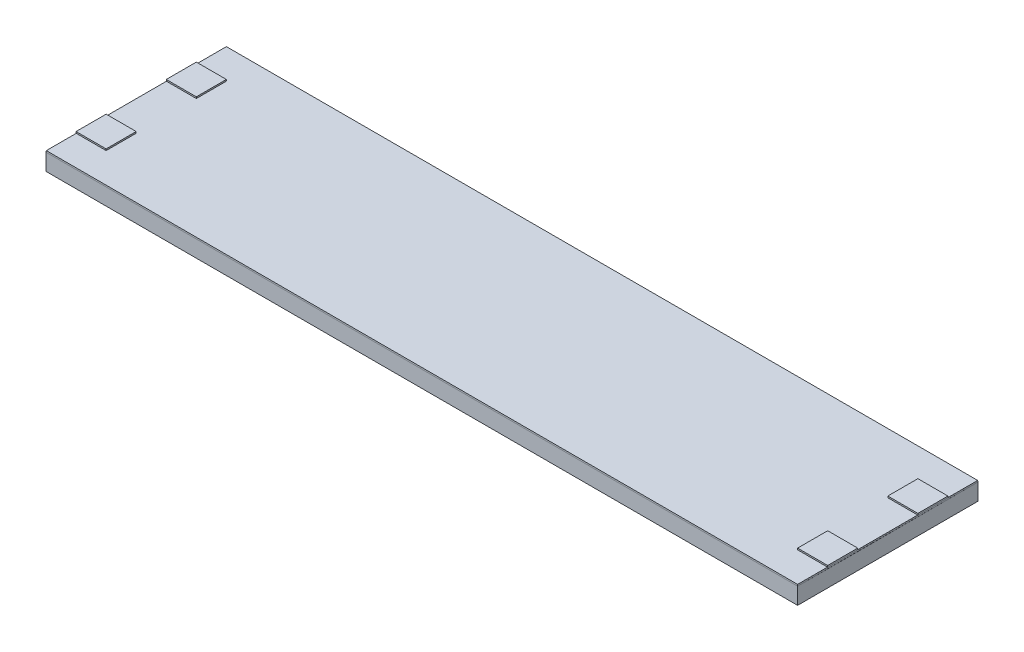
ISO-10303-21;
HEADER;
FILE_DESCRIPTION(('STEP AP214'),'2;1');
FILE_NAME('part.step','',(''),(''),'','','');
FILE_SCHEMA(('AUTOMOTIVE_DESIGN { 1 0 10303 214 1 1 1 1 }'));
ENDSEC;
DATA;
#1=APPLICATION_CONTEXT('core data for automotive mechanical design processes');
#2=APPLICATION_PROTOCOL_DEFINITION('international standard','automotive_design',2000,#1);
#3=PRODUCT_CONTEXT('',#1,'mechanical');
#4=PRODUCT('Part','Part','',(#3));
#5=PRODUCT_RELATED_PRODUCT_CATEGORY('part','',(#4));
#6=PRODUCT_DEFINITION_FORMATION('','',#4);
#7=PRODUCT_DEFINITION_CONTEXT('part definition',#1,'design');
#8=PRODUCT_DEFINITION('design','',#6,#7);
#9=PRODUCT_DEFINITION_SHAPE('','',#8);
#10=(LENGTH_UNIT() NAMED_UNIT(*) SI_UNIT(.MILLI.,.METRE.));
#11=(NAMED_UNIT(*) PLANE_ANGLE_UNIT() SI_UNIT($,.RADIAN.));
#12=(NAMED_UNIT(*) SI_UNIT($,.STERADIAN.) SOLID_ANGLE_UNIT());
#13=UNCERTAINTY_MEASURE_WITH_UNIT(LENGTH_MEASURE(1.E-05),#10,'distance_accuracy_value','');
#14=(GEOMETRIC_REPRESENTATION_CONTEXT(3) GLOBAL_UNCERTAINTY_ASSIGNED_CONTEXT((#13)) GLOBAL_UNIT_ASSIGNED_CONTEXT((#10,
#11,#12)) REPRESENTATION_CONTEXT('',''));
#15=CARTESIAN_POINT('',(0.,0.,0.));
#16=DIRECTION('',(0.,0.,1.));
#17=DIRECTION('',(1.,0.,0.));
#18=AXIS2_PLACEMENT_3D('',#15,#16,#17);
#19=CARTESIAN_POINT('',(0.,1.3,0.));
#20=DIRECTION('',(0.,-1.,0.));
#21=DIRECTION('',(0.,0.,-1.));
#22=AXIS2_PLACEMENT_3D('',#19,#20,#21);
#23=PLANE('',#22);
#24=DIRECTION('',(-1.,0.,0.));
#25=VECTOR('',#24,1.);
#26=CARTESIAN_POINT('',(48.,1.3,-10.));
#27=LINE('',#26,#25);
#28=CARTESIAN_POINT('',(50.,1.3,-10.));
#29=VERTEX_POINT('',#28);
#30=CARTESIAN_POINT('',(48.,1.3,-10.));
#31=VERTEX_POINT('',#30);
#32=EDGE_CURVE('E1162',#29,#31,#27,.T.);
#33=ORIENTED_EDGE('',*,*,#32,.T.);
#34=DIRECTION('',(0.,0.,1.));
#35=VECTOR('',#34,1.);
#36=CARTESIAN_POINT('',(48.,1.3,-10.));
#37=LINE('',#36,#35);
#38=CARTESIAN_POINT('',(48.,1.3,-8.));
#39=VERTEX_POINT('',#38);
#40=EDGE_CURVE('E1290',#31,#39,#37,.T.);
#41=ORIENTED_EDGE('',*,*,#40,.T.);
#42=DIRECTION('',(1.,0.,0.));
#43=VECTOR('',#42,1.);
#44=CARTESIAN_POINT('',(48.,1.3,-8.));
#45=LINE('',#44,#43);
#46=CARTESIAN_POINT('',(50.,1.3,-8.));
#47=VERTEX_POINT('',#46);
#48=EDGE_CURVE('E29',#39,#47,#45,.T.);
#49=ORIENTED_EDGE('',*,*,#48,.T.);
#50=DIRECTION('',(0.,0.,-1.));
#51=VECTOR('',#50,1.);
#52=CARTESIAN_POINT('',(50.,1.3,-10.));
#53=LINE('',#52,#51);
#54=EDGE_CURVE('E11',#47,#29,#53,.T.);
#55=ORIENTED_EDGE('',*,*,#54,.T.);
#56=EDGE_LOOP('',(#33,#41,#49,#55));
#57=FACE_BOUND('',#56,.T.);
#58=ADVANCED_FACE('F16',(#57),#23,.F.);
#59=CARTESIAN_POINT('',(50.,1.3,-10.));
#60=DIRECTION('',(-1.,0.,0.));
#61=DIRECTION('',(0.,0.,1.));
#62=AXIS2_PLACEMENT_3D('',#59,#60,#61);
#63=PLANE('',#62);
#64=DIRECTION('',(0.,0.,-1.));
#65=VECTOR('',#64,1.);
#66=CARTESIAN_POINT('',(50.,1.2,-10.));
#67=LINE('',#66,#65);
#68=CARTESIAN_POINT('',(50.,1.2,-8.));
#69=VERTEX_POINT('',#68);
#70=CARTESIAN_POINT('',(50.,1.2,-10.));
#71=VERTEX_POINT('',#70);
#72=EDGE_CURVE('E1158',#69,#71,#67,.T.);
#73=ORIENTED_EDGE('',*,*,#72,.T.);
#74=DIRECTION('',(0.,-1.,0.));
#75=VECTOR('',#74,1.);
#76=CARTESIAN_POINT('',(50.,1.3,-10.));
#77=LINE('',#76,#75);
#78=EDGE_CURVE('E1167',#29,#71,#77,.T.);
#79=ORIENTED_EDGE('',*,*,#78,.F.);
#80=ORIENTED_EDGE('',*,*,#54,.F.);
#81=DIRECTION('',(0.,-1.,0.));
#82=VECTOR('',#81,1.);
#83=CARTESIAN_POINT('',(50.,1.3,-8.));
#84=LINE('',#83,#82);
#85=EDGE_CURVE('E1294',#47,#69,#84,.T.);
#86=ORIENTED_EDGE('',*,*,#85,.T.);
#87=EDGE_LOOP('',(#73,#79,#80,#86));
#88=FACE_BOUND('',#87,.T.);
#89=ADVANCED_FACE('F455',(#88),#63,.F.);
#90=CARTESIAN_POINT('',(48.,1.3,-8.));
#91=DIRECTION('',(0.,0.,-1.));
#92=DIRECTION('',(0.,-1.,0.));
#93=AXIS2_PLACEMENT_3D('',#90,#91,#92);
#94=PLANE('',#93);
#95=DIRECTION('',(1.,0.,0.));
#96=VECTOR('',#95,1.);
#97=CARTESIAN_POINT('',(48.,1.2,-8.));
#98=LINE('',#97,#96);
#99=CARTESIAN_POINT('',(48.,1.2,-8.));
#100=VERTEX_POINT('',#99);
#101=CARTESIAN_POINT('',(49.99,1.2,-8.));
#102=VERTEX_POINT('',#101);
#103=EDGE_CURVE('E410',#100,#102,#98,.T.);
#104=ORIENTED_EDGE('',*,*,#103,.T.);
#105=DIRECTION('',(1.,0.,0.));
#106=VECTOR('',#105,1.);
#107=CARTESIAN_POINT('',(48.,1.2,-8.));
#108=LINE('',#107,#106);
#109=EDGE_CURVE('E1163',#102,#69,#108,.T.);
#110=ORIENTED_EDGE('',*,*,#109,.T.);
#111=ORIENTED_EDGE('',*,*,#85,.F.);
#112=ORIENTED_EDGE('',*,*,#48,.F.);
#113=DIRECTION('',(0.,-1.,0.));
#114=VECTOR('',#113,1.);
#115=CARTESIAN_POINT('',(48.,1.3,-8.));
#116=LINE('',#115,#114);
#117=EDGE_CURVE('E1170',#39,#100,#116,.T.);
#118=ORIENTED_EDGE('',*,*,#117,.T.);
#119=EDGE_LOOP('',(#104,#110,#111,#112,#118));
#120=FACE_BOUND('',#119,.T.);
#121=ADVANCED_FACE('F459',(#120),#94,.F.);
#122=CARTESIAN_POINT('',(48.,1.3,-10.));
#123=DIRECTION('',(1.,0.,0.));
#124=DIRECTION('',(0.,1.,0.));
#125=AXIS2_PLACEMENT_3D('',#122,#123,#124);
#126=PLANE('',#125);
#127=DIRECTION('',(0.,0.,1.));
#128=VECTOR('',#127,1.);
#129=CARTESIAN_POINT('',(48.,1.2,-10.));
#130=LINE('',#129,#128);
#131=CARTESIAN_POINT('',(48.,1.2,-10.));
#132=VERTEX_POINT('',#131);
#133=EDGE_CURVE('E1175',#132,#100,#130,.T.);
#134=ORIENTED_EDGE('',*,*,#133,.T.);
#135=ORIENTED_EDGE('',*,*,#117,.F.);
#136=ORIENTED_EDGE('',*,*,#40,.F.);
#137=DIRECTION('',(0.,-1.,0.));
#138=VECTOR('',#137,1.);
#139=CARTESIAN_POINT('',(48.,1.3,-10.));
#140=LINE('',#139,#138);
#141=EDGE_CURVE('E1159',#31,#132,#140,.T.);
#142=ORIENTED_EDGE('',*,*,#141,.T.);
#143=EDGE_LOOP('',(#134,#135,#136,#142));
#144=FACE_BOUND('',#143,.T.);
#145=ADVANCED_FACE('F745',(#144),#126,.F.);
#146=CARTESIAN_POINT('',(48.,1.3,-10.));
#147=DIRECTION('',(0.,0.,1.));
#148=DIRECTION('',(1.,0.,0.));
#149=AXIS2_PLACEMENT_3D('',#146,#147,#148);
#150=PLANE('',#149);
#151=DIRECTION('',(-1.,0.,0.));
#152=VECTOR('',#151,1.);
#153=CARTESIAN_POINT('',(48.,1.2,-10.));
#154=LINE('',#153,#152);
#155=CARTESIAN_POINT('',(49.99,1.2,-10.));
#156=VERTEX_POINT('',#155);
#157=EDGE_CURVE('E1134',#71,#156,#154,.T.);
#158=ORIENTED_EDGE('',*,*,#157,.T.);
#159=DIRECTION('',(-1.,0.,0.));
#160=VECTOR('',#159,1.);
#161=CARTESIAN_POINT('',(48.,1.2,-10.));
#162=LINE('',#161,#160);
#163=EDGE_CURVE('E1171',#156,#132,#162,.T.);
#164=ORIENTED_EDGE('',*,*,#163,.T.);
#165=ORIENTED_EDGE('',*,*,#141,.F.);
#166=ORIENTED_EDGE('',*,*,#32,.F.);
#167=ORIENTED_EDGE('',*,*,#78,.T.);
#168=EDGE_LOOP('',(#158,#164,#165,#166,#167));
#169=FACE_BOUND('',#168,.T.);
#170=ADVANCED_FACE('F643',(#169),#150,.F.);
#171=CARTESIAN_POINT('',(0.,1.2,0.));
#172=DIRECTION('',(0.,-1.,0.));
#173=DIRECTION('',(0.,0.,-1.));
#174=AXIS2_PLACEMENT_3D('',#171,#172,#173);
#175=PLANE('',#174);
#176=DIRECTION('',(0.,0.,-1.));
#177=VECTOR('',#176,1.);
#178=CARTESIAN_POINT('',(49.99,1.2,0.));
#179=LINE('',#178,#177);
#180=EDGE_CURVE('E415',#102,#156,#179,.T.);
#181=ORIENTED_EDGE('',*,*,#180,.T.);
#182=ORIENTED_EDGE('',*,*,#157,.F.);
#183=ORIENTED_EDGE('',*,*,#72,.F.);
#184=ORIENTED_EDGE('',*,*,#109,.F.);
#185=EDGE_LOOP('',(#181,#182,#183,#184));
#186=FACE_BOUND('',#185,.T.);
#187=ADVANCED_FACE('F480',(#186),#175,.T.);
#188=CARTESIAN_POINT('',(0.,1.3,0.));
#189=DIRECTION('',(0.,-1.,0.));
#190=DIRECTION('',(0.,0.,-1.));
#191=AXIS2_PLACEMENT_3D('',#188,#189,#190);
#192=PLANE('',#191);
#193=DIRECTION('',(0.,0.,1.));
#194=VECTOR('',#193,1.);
#195=CARTESIAN_POINT('',(48.,1.3,-2.));
#196=LINE('',#195,#194);
#197=CARTESIAN_POINT('',(48.,1.3,-4.));
#198=VERTEX_POINT('',#197);
#199=CARTESIAN_POINT('',(48.,1.3,-2.));
#200=VERTEX_POINT('',#199);
#201=EDGE_CURVE('E1216',#198,#200,#196,.T.);
#202=ORIENTED_EDGE('',*,*,#201,.T.);
#203=DIRECTION('',(1.,0.,0.));
#204=VECTOR('',#203,1.);
#205=CARTESIAN_POINT('',(48.,1.3,-2.));
#206=LINE('',#205,#204);
#207=CARTESIAN_POINT('',(50.,1.3,-2.));
#208=VERTEX_POINT('',#207);
#209=EDGE_CURVE('E1138',#200,#208,#206,.T.);
#210=ORIENTED_EDGE('',*,*,#209,.T.);
#211=DIRECTION('',(0.,0.,-1.));
#212=VECTOR('',#211,1.);
#213=CARTESIAN_POINT('',(50.,1.3,-2.));
#214=LINE('',#213,#212);
#215=CARTESIAN_POINT('',(50.,1.3,-4.));
#216=VERTEX_POINT('',#215);
#217=EDGE_CURVE('E1135',#208,#216,#214,.T.);
#218=ORIENTED_EDGE('',*,*,#217,.T.);
#219=DIRECTION('',(-1.,0.,0.));
#220=VECTOR('',#219,1.);
#221=CARTESIAN_POINT('',(48.,1.3,-4.));
#222=LINE('',#221,#220);
#223=EDGE_CURVE('E1127',#216,#198,#222,.T.);
#224=ORIENTED_EDGE('',*,*,#223,.T.);
#225=EDGE_LOOP('',(#202,#210,#218,#224));
#226=FACE_BOUND('',#225,.T.);
#227=ADVANCED_FACE('F452',(#226),#192,.F.);
#228=CARTESIAN_POINT('',(48.,1.3,-4.));
#229=DIRECTION('',(0.,0.,1.));
#230=DIRECTION('',(1.,0.,0.));
#231=AXIS2_PLACEMENT_3D('',#228,#229,#230);
#232=PLANE('',#231);
#233=DIRECTION('',(-1.,0.,0.));
#234=VECTOR('',#233,1.);
#235=CARTESIAN_POINT('',(48.,1.2,-4.));
#236=LINE('',#235,#234);
#237=CARTESIAN_POINT('',(50.,1.2,-4.));
#238=VERTEX_POINT('',#237);
#239=CARTESIAN_POINT('',(49.99,1.2,-4.));
#240=VERTEX_POINT('',#239);
#241=EDGE_CURVE('E300',#238,#240,#236,.T.);
#242=ORIENTED_EDGE('',*,*,#241,.T.);
#243=DIRECTION('',(-1.,0.,0.));
#244=VECTOR('',#243,1.);
#245=CARTESIAN_POINT('',(48.,1.2,-4.));
#246=LINE('',#245,#244);
#247=CARTESIAN_POINT('',(48.,1.2,-4.));
#248=VERTEX_POINT('',#247);
#249=EDGE_CURVE('E1243',#240,#248,#246,.T.);
#250=ORIENTED_EDGE('',*,*,#249,.T.);
#251=DIRECTION('',(0.,-1.,0.));
#252=VECTOR('',#251,1.);
#253=CARTESIAN_POINT('',(48.,1.3,-4.));
#254=LINE('',#253,#252);
#255=EDGE_CURVE('E1130',#198,#248,#254,.T.);
#256=ORIENTED_EDGE('',*,*,#255,.F.);
#257=ORIENTED_EDGE('',*,*,#223,.F.);
#258=DIRECTION('',(0.,-1.,0.));
#259=VECTOR('',#258,1.);
#260=CARTESIAN_POINT('',(50.,1.3,-4.));
#261=LINE('',#260,#259);
#262=EDGE_CURVE('E203',#216,#238,#261,.T.);
#263=ORIENTED_EDGE('',*,*,#262,.T.);
#264=EDGE_LOOP('',(#242,#250,#256,#257,#263));
#265=FACE_BOUND('',#264,.T.);
#266=ADVANCED_FACE('F448',(#265),#232,.F.);
#267=CARTESIAN_POINT('',(50.,1.3,-2.));
#268=DIRECTION('',(-1.,0.,0.));
#269=DIRECTION('',(0.,0.,1.));
#270=AXIS2_PLACEMENT_3D('',#267,#268,#269);
#271=PLANE('',#270);
#272=DIRECTION('',(0.,0.,-1.));
#273=VECTOR('',#272,1.);
#274=CARTESIAN_POINT('',(50.,1.2,-2.));
#275=LINE('',#274,#273);
#276=CARTESIAN_POINT('',(50.,1.2,-2.));
#277=VERTEX_POINT('',#276);
#278=EDGE_CURVE('E363',#277,#238,#275,.T.);
#279=ORIENTED_EDGE('',*,*,#278,.T.);
#280=ORIENTED_EDGE('',*,*,#262,.F.);
#281=ORIENTED_EDGE('',*,*,#217,.F.);
#282=DIRECTION('',(0.,-1.,0.));
#283=VECTOR('',#282,1.);
#284=CARTESIAN_POINT('',(50.,1.3,-2.));
#285=LINE('',#284,#283);
#286=EDGE_CURVE('E1148',#208,#277,#285,.T.);
#287=ORIENTED_EDGE('',*,*,#286,.T.);
#288=EDGE_LOOP('',(#279,#280,#281,#287));
#289=FACE_BOUND('',#288,.T.);
#290=ADVANCED_FACE('F451',(#289),#271,.F.);
#291=CARTESIAN_POINT('',(48.,1.3,-2.));
#292=DIRECTION('',(0.,0.,-1.));
#293=DIRECTION('',(0.,-1.,0.));
#294=AXIS2_PLACEMENT_3D('',#291,#292,#293);
#295=PLANE('',#294);
#296=DIRECTION('',(1.,0.,0.));
#297=VECTOR('',#296,1.);
#298=CARTESIAN_POINT('',(48.,1.2,-2.));
#299=LINE('',#298,#297);
#300=CARTESIAN_POINT('',(48.,1.2,-2.));
#301=VERTEX_POINT('',#300);
#302=CARTESIAN_POINT('',(49.99,1.2,-2.));
#303=VERTEX_POINT('',#302);
#304=EDGE_CURVE('E1244',#301,#303,#299,.T.);
#305=ORIENTED_EDGE('',*,*,#304,.T.);
#306=DIRECTION('',(1.,0.,0.));
#307=VECTOR('',#306,1.);
#308=CARTESIAN_POINT('',(48.,1.2,-2.));
#309=LINE('',#308,#307);
#310=EDGE_CURVE('E100',#303,#277,#309,.T.);
#311=ORIENTED_EDGE('',*,*,#310,.T.);
#312=ORIENTED_EDGE('',*,*,#286,.F.);
#313=ORIENTED_EDGE('',*,*,#209,.F.);
#314=DIRECTION('',(0.,-1.,0.));
#315=VECTOR('',#314,1.);
#316=CARTESIAN_POINT('',(48.,1.3,-2.));
#317=LINE('',#316,#315);
#318=EDGE_CURVE('E1210',#200,#301,#317,.T.);
#319=ORIENTED_EDGE('',*,*,#318,.T.);
#320=EDGE_LOOP('',(#305,#311,#312,#313,#319));
#321=FACE_BOUND('',#320,.T.);
#322=ADVANCED_FACE('F534',(#321),#295,.F.);
#323=CARTESIAN_POINT('',(48.,1.3,-2.));
#324=DIRECTION('',(1.,0.,0.));
#325=DIRECTION('',(0.,0.,-1.));
#326=AXIS2_PLACEMENT_3D('',#323,#324,#325);
#327=PLANE('',#326);
#328=DIRECTION('',(0.,0.,1.));
#329=VECTOR('',#328,1.);
#330=CARTESIAN_POINT('',(48.,1.2,-2.));
#331=LINE('',#330,#329);
#332=EDGE_CURVE('E1239',#248,#301,#331,.T.);
#333=ORIENTED_EDGE('',*,*,#332,.T.);
#334=ORIENTED_EDGE('',*,*,#318,.F.);
#335=ORIENTED_EDGE('',*,*,#201,.F.);
#336=ORIENTED_EDGE('',*,*,#255,.T.);
#337=EDGE_LOOP('',(#333,#334,#335,#336));
#338=FACE_BOUND('',#337,.T.);
#339=ADVANCED_FACE('F472',(#338),#327,.F.);
#340=CARTESIAN_POINT('',(0.,1.2,0.));
#341=DIRECTION('',(0.,-1.,0.));
#342=DIRECTION('',(0.,0.,-1.));
#343=AXIS2_PLACEMENT_3D('',#340,#341,#342);
#344=PLANE('',#343);
#345=DIRECTION('',(0.,0.,-1.));
#346=VECTOR('',#345,1.);
#347=CARTESIAN_POINT('',(49.99,1.2,0.));
#348=LINE('',#347,#346);
#349=EDGE_CURVE('E390',#303,#240,#348,.T.);
#350=ORIENTED_EDGE('',*,*,#349,.T.);
#351=ORIENTED_EDGE('',*,*,#241,.F.);
#352=ORIENTED_EDGE('',*,*,#278,.F.);
#353=ORIENTED_EDGE('',*,*,#310,.F.);
#354=EDGE_LOOP('',(#350,#351,#352,#353));
#355=FACE_BOUND('',#354,.T.);
#356=ADVANCED_FACE('F469',(#355),#344,.T.);
#357=CARTESIAN_POINT('',(0.,1.3,0.));
#358=DIRECTION('',(0.,-1.,0.));
#359=DIRECTION('',(0.,0.,-1.));
#360=AXIS2_PLACEMENT_3D('',#357,#358,#359);
#361=PLANE('',#360);
#362=DIRECTION('',(1.,0.,0.));
#363=VECTOR('',#362,1.);
#364=CARTESIAN_POINT('',(2.,1.3,-2.));
#365=LINE('',#364,#363);
#366=CARTESIAN_POINT('',(0.,1.3,-2.));
#367=VERTEX_POINT('',#366);
#368=CARTESIAN_POINT('',(2.,1.3,-2.));
#369=VERTEX_POINT('',#368);
#370=EDGE_CURVE('E295',#367,#369,#365,.T.);
#371=ORIENTED_EDGE('',*,*,#370,.T.);
#372=DIRECTION('',(0.,0.,-1.));
#373=VECTOR('',#372,1.);
#374=CARTESIAN_POINT('',(2.,1.3,-2.));
#375=LINE('',#374,#373);
#376=CARTESIAN_POINT('',(2.,1.3,-4.));
#377=VERTEX_POINT('',#376);
#378=EDGE_CURVE('E351',#369,#377,#375,.T.);
#379=ORIENTED_EDGE('',*,*,#378,.T.);
#380=DIRECTION('',(-1.,0.,0.));
#381=VECTOR('',#380,1.);
#382=CARTESIAN_POINT('',(2.,1.3,-4.));
#383=LINE('',#382,#381);
#384=CARTESIAN_POINT('',(0.,1.3,-4.));
#385=VERTEX_POINT('',#384);
#386=EDGE_CURVE('E297',#377,#385,#383,.T.);
#387=ORIENTED_EDGE('',*,*,#386,.T.);
#388=DIRECTION('',(0.,0.,1.));
#389=VECTOR('',#388,1.);
#390=CARTESIAN_POINT('',(0.,1.3,-2.));
#391=LINE('',#390,#389);
#392=EDGE_CURVE('E215',#385,#367,#391,.T.);
#393=ORIENTED_EDGE('',*,*,#392,.T.);
#394=EDGE_LOOP('',(#371,#379,#387,#393));
#395=FACE_BOUND('',#394,.T.);
#396=ADVANCED_FACE('F292',(#395),#361,.F.);
#397=CARTESIAN_POINT('',(0.,1.3,-2.));
#398=DIRECTION('',(1.,0.,0.));
#399=DIRECTION('',(0.,0.,1.));
#400=AXIS2_PLACEMENT_3D('',#397,#398,#399);
#401=PLANE('',#400);
#402=DIRECTION('',(0.,0.,1.));
#403=VECTOR('',#402,1.);
#404=CARTESIAN_POINT('',(0.,1.2,-2.));
#405=LINE('',#404,#403);
#406=CARTESIAN_POINT('',(0.,1.2,-4.));
#407=VERTEX_POINT('',#406);
#408=CARTESIAN_POINT('',(0.,1.2,-2.));
#409=VERTEX_POINT('',#408);
#410=EDGE_CURVE('E306',#407,#409,#405,.T.);
#411=ORIENTED_EDGE('',*,*,#410,.T.);
#412=DIRECTION('',(0.,-1.,0.));
#413=VECTOR('',#412,1.);
#414=CARTESIAN_POINT('',(0.,1.3,-2.));
#415=LINE('',#414,#413);
#416=EDGE_CURVE('E303',#367,#409,#415,.T.);
#417=ORIENTED_EDGE('',*,*,#416,.F.);
#418=ORIENTED_EDGE('',*,*,#392,.F.);
#419=DIRECTION('',(0.,-1.,0.));
#420=VECTOR('',#419,1.);
#421=CARTESIAN_POINT('',(0.,1.3,-4.));
#422=LINE('',#421,#420);
#423=EDGE_CURVE('E348',#385,#407,#422,.T.);
#424=ORIENTED_EDGE('',*,*,#423,.T.);
#425=EDGE_LOOP('',(#411,#417,#418,#424));
#426=FACE_BOUND('',#425,.T.);
#427=ADVANCED_FACE('F304',(#426),#401,.F.);
#428=CARTESIAN_POINT('',(2.,1.3,-4.));
#429=DIRECTION('',(0.,0.,1.));
#430=DIRECTION('',(1.,0.,0.));
#431=AXIS2_PLACEMENT_3D('',#428,#429,#430);
#432=PLANE('',#431);
#433=DIRECTION('',(-1.,0.,0.));
#434=VECTOR('',#433,1.);
#435=CARTESIAN_POINT('',(2.,1.2,-4.));
#436=LINE('',#435,#434);
#437=CARTESIAN_POINT('',(2.,1.2,-4.));
#438=VERTEX_POINT('',#437);
#439=CARTESIAN_POINT('',(0.01,1.2,-4.));
#440=VERTEX_POINT('',#439);
#441=EDGE_CURVE('E1197',#438,#440,#436,.T.);
#442=ORIENTED_EDGE('',*,*,#441,.T.);
#443=DIRECTION('',(-1.,0.,0.));
#444=VECTOR('',#443,1.);
#445=CARTESIAN_POINT('',(2.,1.2,-4.));
#446=LINE('',#445,#444);
#447=EDGE_CURVE('E322',#440,#407,#446,.T.);
#448=ORIENTED_EDGE('',*,*,#447,.T.);
#449=ORIENTED_EDGE('',*,*,#423,.F.);
#450=ORIENTED_EDGE('',*,*,#386,.F.);
#451=DIRECTION('',(0.,-1.,0.));
#452=VECTOR('',#451,1.);
#453=CARTESIAN_POINT('',(2.,1.3,-4.));
#454=LINE('',#453,#452);
#455=EDGE_CURVE('E310',#377,#438,#454,.T.);
#456=ORIENTED_EDGE('',*,*,#455,.T.);
#457=EDGE_LOOP('',(#442,#448,#449,#450,#456));
#458=FACE_BOUND('',#457,.T.);
#459=ADVANCED_FACE('F473',(#458),#432,.F.);
#460=CARTESIAN_POINT('',(2.,1.3,-2.));
#461=DIRECTION('',(-1.,0.,0.));
#462=DIRECTION('',(0.,0.,1.));
#463=AXIS2_PLACEMENT_3D('',#460,#461,#462);
#464=PLANE('',#463);
#465=DIRECTION('',(0.,0.,-1.));
#466=VECTOR('',#465,1.);
#467=CARTESIAN_POINT('',(2.,1.2,-2.));
#468=LINE('',#467,#466);
#469=CARTESIAN_POINT('',(2.,1.2,-2.));
#470=VERTEX_POINT('',#469);
#471=EDGE_CURVE('E1248',#470,#438,#468,.T.);
#472=ORIENTED_EDGE('',*,*,#471,.T.);
#473=ORIENTED_EDGE('',*,*,#455,.F.);
#474=ORIENTED_EDGE('',*,*,#378,.F.);
#475=DIRECTION('',(0.,-1.,0.));
#476=VECTOR('',#475,1.);
#477=CARTESIAN_POINT('',(2.,1.3,-2.));
#478=LINE('',#477,#476);
#479=EDGE_CURVE('E314',#369,#470,#478,.T.);
#480=ORIENTED_EDGE('',*,*,#479,.T.);
#481=EDGE_LOOP('',(#472,#473,#474,#480));
#482=FACE_BOUND('',#481,.T.);
#483=ADVANCED_FACE('F476',(#482),#464,.F.);
#484=CARTESIAN_POINT('',(2.,1.3,-2.));
#485=DIRECTION('',(0.,0.,-1.));
#486=DIRECTION('',(0.,-1.,0.));
#487=AXIS2_PLACEMENT_3D('',#484,#485,#486);
#488=PLANE('',#487);
#489=DIRECTION('',(1.,0.,0.));
#490=VECTOR('',#489,1.);
#491=CARTESIAN_POINT('',(2.,1.2,-2.));
#492=LINE('',#491,#490);
#493=CARTESIAN_POINT('',(0.01,1.2,-2.));
#494=VERTEX_POINT('',#493);
#495=EDGE_CURVE('E1222',#409,#494,#492,.T.);
#496=ORIENTED_EDGE('',*,*,#495,.T.);
#497=DIRECTION('',(-1.,0.,0.));
#498=VECTOR('',#497,1.);
#499=CARTESIAN_POINT('',(0.,1.2,-2.));
#500=LINE('',#499,#498);
#501=EDGE_CURVE('E342',#470,#494,#500,.T.);
#502=ORIENTED_EDGE('',*,*,#501,.F.);
#503=ORIENTED_EDGE('',*,*,#479,.F.);
#504=ORIENTED_EDGE('',*,*,#370,.F.);
#505=ORIENTED_EDGE('',*,*,#416,.T.);
#506=EDGE_LOOP('',(#496,#502,#503,#504,#505));
#507=FACE_BOUND('',#506,.T.);
#508=ADVANCED_FACE('F312',(#507),#488,.F.);
#509=CARTESIAN_POINT('',(0.,1.2,0.));
#510=DIRECTION('',(0.,-1.,0.));
#511=DIRECTION('',(0.,0.,-1.));
#512=AXIS2_PLACEMENT_3D('',#509,#510,#511);
#513=PLANE('',#512);
#514=DIRECTION('',(0.,0.,1.));
#515=VECTOR('',#514,1.);
#516=CARTESIAN_POINT('',(0.01,1.2,0.));
#517=LINE('',#516,#515);
#518=EDGE_CURVE('E366',#440,#494,#517,.T.);
#519=ORIENTED_EDGE('',*,*,#518,.T.);
#520=ORIENTED_EDGE('',*,*,#495,.F.);
#521=ORIENTED_EDGE('',*,*,#410,.F.);
#522=ORIENTED_EDGE('',*,*,#447,.F.);
#523=EDGE_LOOP('',(#519,#520,#521,#522));
#524=FACE_BOUND('',#523,.T.);
#525=ADVANCED_FACE('F588',(#524),#513,.T.);
#526=CARTESIAN_POINT('',(0.,1.2,0.));
#527=DIRECTION('',(0.,-1.,0.));
#528=DIRECTION('',(0.,0.,-1.));
#529=AXIS2_PLACEMENT_3D('',#526,#527,#528);
#530=PLANE('',#529);
#531=DIRECTION('',(-1.,0.,0.));
#532=VECTOR('',#531,1.);
#533=CARTESIAN_POINT('',(2.,1.2,-10.));
#534=LINE('',#533,#532);
#535=CARTESIAN_POINT('',(0.01,1.2,-10.));
#536=VERTEX_POINT('',#535);
#537=CARTESIAN_POINT('',(0.,1.2,-10.));
#538=VERTEX_POINT('',#537);
#539=EDGE_CURVE('E1201',#536,#538,#534,.T.);
#540=ORIENTED_EDGE('',*,*,#539,.F.);
#541=DIRECTION('',(0.,0.,1.));
#542=VECTOR('',#541,1.);
#543=CARTESIAN_POINT('',(0.01,1.2,0.));
#544=LINE('',#543,#542);
#545=CARTESIAN_POINT('',(0.01,1.2,-8.));
#546=VERTEX_POINT('',#545);
#547=EDGE_CURVE('E1247',#536,#546,#544,.T.);
#548=ORIENTED_EDGE('',*,*,#547,.T.);
#549=DIRECTION('',(1.,0.,0.));
#550=VECTOR('',#549,1.);
#551=CARTESIAN_POINT('',(2.,1.2,-8.));
#552=LINE('',#551,#550);
#553=CARTESIAN_POINT('',(0.,1.2,-8.));
#554=VERTEX_POINT('',#553);
#555=EDGE_CURVE('E1155',#554,#546,#552,.T.);
#556=ORIENTED_EDGE('',*,*,#555,.F.);
#557=DIRECTION('',(0.,0.,1.));
#558=VECTOR('',#557,1.);
#559=CARTESIAN_POINT('',(0.,1.2,-10.));
#560=LINE('',#559,#558);
#561=EDGE_CURVE('E262',#538,#554,#560,.T.);
#562=ORIENTED_EDGE('',*,*,#561,.F.);
#563=EDGE_LOOP('',(#540,#548,#556,#562));
#564=FACE_BOUND('',#563,.T.);
#565=ADVANCED_FACE('F758',(#564),#530,.T.);
#566=CARTESIAN_POINT('',(0.,1.3,0.));
#567=DIRECTION('',(0.,-1.,0.));
#568=DIRECTION('',(0.,0.,-1.));
#569=AXIS2_PLACEMENT_3D('',#566,#567,#568);
#570=PLANE('',#569);
#571=DIRECTION('',(0.,0.,-1.));
#572=VECTOR('',#571,1.);
#573=CARTESIAN_POINT('',(2.,1.3,-10.));
#574=LINE('',#573,#572);
#575=CARTESIAN_POINT('',(2.,1.3,-8.));
#576=VERTEX_POINT('',#575);
#577=CARTESIAN_POINT('',(2.,1.3,-10.));
#578=VERTEX_POINT('',#577);
#579=EDGE_CURVE('E1179',#576,#578,#574,.T.);
#580=ORIENTED_EDGE('',*,*,#579,.T.);
#581=DIRECTION('',(-1.,0.,0.));
#582=VECTOR('',#581,1.);
#583=CARTESIAN_POINT('',(2.,1.3,-10.));
#584=LINE('',#583,#582);
#585=CARTESIAN_POINT('',(0.,1.3,-10.));
#586=VERTEX_POINT('',#585);
#587=EDGE_CURVE('E331',#578,#586,#584,.T.);
#588=ORIENTED_EDGE('',*,*,#587,.T.);
#589=DIRECTION('',(0.,0.,1.));
#590=VECTOR('',#589,1.);
#591=CARTESIAN_POINT('',(0.,1.3,-10.));
#592=LINE('',#591,#590);
#593=CARTESIAN_POINT('',(0.,1.3,-8.));
#594=VERTEX_POINT('',#593);
#595=EDGE_CURVE('E274',#586,#594,#592,.T.);
#596=ORIENTED_EDGE('',*,*,#595,.T.);
#597=DIRECTION('',(1.,0.,0.));
#598=VECTOR('',#597,1.);
#599=CARTESIAN_POINT('',(2.,1.3,-8.));
#600=LINE('',#599,#598);
#601=EDGE_CURVE('E1225',#594,#576,#600,.T.);
#602=ORIENTED_EDGE('',*,*,#601,.T.);
#603=EDGE_LOOP('',(#580,#588,#596,#602));
#604=FACE_BOUND('',#603,.T.);
#605=ADVANCED_FACE('F753',(#604),#570,.F.);
#606=CARTESIAN_POINT('',(2.,1.3,-8.));
#607=DIRECTION('',(0.,0.,-1.));
#608=DIRECTION('',(0.,-1.,0.));
#609=AXIS2_PLACEMENT_3D('',#606,#607,#608);
#610=PLANE('',#609);
#611=ORIENTED_EDGE('',*,*,#555,.T.);
#612=DIRECTION('',(1.,0.,0.));
#613=VECTOR('',#612,1.);
#614=CARTESIAN_POINT('',(2.,1.2,-8.));
#615=LINE('',#614,#613);
#616=CARTESIAN_POINT('',(2.,1.2,-8.));
#617=VERTEX_POINT('',#616);
#618=EDGE_CURVE('E336',#546,#617,#615,.T.);
#619=ORIENTED_EDGE('',*,*,#618,.T.);
#620=DIRECTION('',(0.,-1.,0.));
#621=VECTOR('',#620,1.);
#622=CARTESIAN_POINT('',(2.,1.3,-8.));
#623=LINE('',#622,#621);
#624=EDGE_CURVE('E1183',#576,#617,#623,.T.);
#625=ORIENTED_EDGE('',*,*,#624,.F.);
#626=ORIENTED_EDGE('',*,*,#601,.F.);
#627=DIRECTION('',(0.,-1.,0.));
#628=VECTOR('',#627,1.);
#629=CARTESIAN_POINT('',(0.,1.3,-8.));
#630=LINE('',#629,#628);
#631=EDGE_CURVE('E330',#594,#554,#630,.T.);
#632=ORIENTED_EDGE('',*,*,#631,.T.);
#633=EDGE_LOOP('',(#611,#619,#625,#626,#632));
#634=FACE_BOUND('',#633,.T.);
#635=ADVANCED_FACE('F463',(#634),#610,.F.);
#636=CARTESIAN_POINT('',(0.,1.3,-10.));
#637=DIRECTION('',(1.,0.,0.));
#638=DIRECTION('',(0.,0.,-1.));
#639=AXIS2_PLACEMENT_3D('',#636,#637,#638);
#640=PLANE('',#639);
#641=ORIENTED_EDGE('',*,*,#561,.T.);
#642=ORIENTED_EDGE('',*,*,#631,.F.);
#643=ORIENTED_EDGE('',*,*,#595,.F.);
#644=DIRECTION('',(0.,-1.,0.));
#645=VECTOR('',#644,1.);
#646=CARTESIAN_POINT('',(0.,1.3,-10.));
#647=LINE('',#646,#645);
#648=EDGE_CURVE('E1186',#586,#538,#647,.T.);
#649=ORIENTED_EDGE('',*,*,#648,.T.);
#650=EDGE_LOOP('',(#641,#642,#643,#649));
#651=FACE_BOUND('',#650,.T.);
#652=ADVANCED_FACE('F460',(#651),#640,.F.);
#653=CARTESIAN_POINT('',(2.,1.3,-10.));
#654=DIRECTION('',(0.,0.,1.));
#655=DIRECTION('',(1.,0.,0.));
#656=AXIS2_PLACEMENT_3D('',#653,#654,#655);
#657=PLANE('',#656);
#658=DIRECTION('',(-1.,0.,0.));
#659=VECTOR('',#658,1.);
#660=CARTESIAN_POINT('',(2.,1.2,-10.));
#661=LINE('',#660,#659);
#662=CARTESIAN_POINT('',(2.,1.2,-10.));
#663=VERTEX_POINT('',#662);
#664=EDGE_CURVE('E337',#663,#536,#661,.T.);
#665=ORIENTED_EDGE('',*,*,#664,.T.);
#666=ORIENTED_EDGE('',*,*,#539,.T.);
#667=ORIENTED_EDGE('',*,*,#648,.F.);
#668=ORIENTED_EDGE('',*,*,#587,.F.);
#669=DIRECTION('',(0.,-1.,0.));
#670=VECTOR('',#669,1.);
#671=CARTESIAN_POINT('',(2.,1.3,-10.));
#672=LINE('',#671,#670);
#673=EDGE_CURVE('E1184',#578,#663,#672,.T.);
#674=ORIENTED_EDGE('',*,*,#673,.T.);
#675=EDGE_LOOP('',(#665,#666,#667,#668,#674));
#676=FACE_BOUND('',#675,.T.);
#677=ADVANCED_FACE('F18',(#676),#657,.F.);
#678=CARTESIAN_POINT('',(2.,1.3,-10.));
#679=DIRECTION('',(-1.,0.,0.));
#680=DIRECTION('',(0.,1.,0.));
#681=AXIS2_PLACEMENT_3D('',#678,#679,#680);
#682=PLANE('',#681);
#683=DIRECTION('',(0.,0.,-1.));
#684=VECTOR('',#683,1.);
#685=CARTESIAN_POINT('',(2.,1.2,-10.));
#686=LINE('',#685,#684);
#687=EDGE_CURVE('E332',#617,#663,#686,.T.);
#688=ORIENTED_EDGE('',*,*,#687,.T.);
#689=ORIENTED_EDGE('',*,*,#673,.F.);
#690=ORIENTED_EDGE('',*,*,#579,.F.);
#691=ORIENTED_EDGE('',*,*,#624,.T.);
#692=EDGE_LOOP('',(#688,#689,#690,#691));
#693=FACE_BOUND('',#692,.T.);
#694=ADVANCED_FACE('F815',(#693),#682,.F.);
#695=CARTESIAN_POINT('',(0.,1.2,-0.01));
#696=DIRECTION('',(0.,0.,-1.));
#697=DIRECTION('',(0.,-1.,0.));
#698=AXIS2_PLACEMENT_3D('',#695,#696,#697);
#699=PLANE('',#698);
#700=CARTESIAN_POINT('',(0.005,1.1,-0.01));
#701=DIRECTION('',(1.,0.,0.));
#702=VECTOR('',#701,1.);
#703=LINE('',#700,#702);
#704=CARTESIAN_POINT('',(0.005,1.1,-0.005));
#705=VERTEX_POINT('',#704);
#706=CARTESIAN_POINT('',(49.995,1.1,-0.005));
#707=VERTEX_POINT('',#706);
#708=EDGE_CURVE('E397',#705,#707,#703,.T.);
#709=ORIENTED_EDGE('',*,*,#708,.T.);
#710=DIRECTION('',(0.,-1.,0.));
#711=VECTOR('',#710,1.);
#712=CARTESIAN_POINT('',(49.99,1.2,-0.01));
#713=LINE('',#712,#711);
#714=CARTESIAN_POINT('',(49.99,1.2,-0.01));
#715=VERTEX_POINT('',#714);
#716=EDGE_CURVE('E117',#715,#707,#713,.T.);
#717=ORIENTED_EDGE('',*,*,#716,.F.);
#718=DIRECTION('',(1.,0.,0.));
#719=VECTOR('',#718,1.);
#720=CARTESIAN_POINT('',(0.,1.2,-0.01));
#721=LINE('',#720,#719);
#722=CARTESIAN_POINT('',(0.01,1.2,-0.01));
#723=VERTEX_POINT('',#722);
#724=EDGE_CURVE('E326',#723,#715,#721,.T.);
#725=ORIENTED_EDGE('',*,*,#724,.F.);
#726=DIRECTION('',(0.,-1.,0.));
#727=VECTOR('',#726,1.);
#728=CARTESIAN_POINT('',(0.01,1.2,-0.01));
#729=LINE('',#728,#727);
#730=EDGE_CURVE('E235',#723,#705,#729,.T.);
#731=ORIENTED_EDGE('',*,*,#730,.T.);
#732=EDGE_LOOP('',(#709,#717,#725,#731));
#733=FACE_BOUND('',#732,.T.);
#734=ADVANCED_FACE('F485',(#733),#699,.F.);
#735=CARTESIAN_POINT('',(0.01,1.2,0.));
#736=DIRECTION('',(1.,0.,0.));
#737=DIRECTION('',(0.,1.,0.));
#738=AXIS2_PLACEMENT_3D('',#735,#736,#737);
#739=PLANE('',#738);
#740=CARTESIAN_POINT('',(0.01,1.1,-11.995));
#741=DIRECTION('',(0.,0.,1.));
#742=VECTOR('',#741,1.);
#743=LINE('',#740,#742);
#744=CARTESIAN_POINT('',(0.005,1.1,-11.995));
#745=VERTEX_POINT('',#744);
#746=EDGE_CURVE('E373',#745,#705,#743,.T.);
#747=ORIENTED_EDGE('',*,*,#746,.T.);
#748=ORIENTED_EDGE('',*,*,#730,.F.);
#749=DIRECTION('',(0.,0.,1.));
#750=VECTOR('',#749,1.);
#751=CARTESIAN_POINT('',(0.01,1.2,0.));
#752=LINE('',#751,#750);
#753=EDGE_CURVE('E338',#494,#723,#752,.T.);
#754=ORIENTED_EDGE('',*,*,#753,.F.);
#755=ORIENTED_EDGE('',*,*,#518,.F.);
#756=DIRECTION('',(0.,0.,1.));
#757=VECTOR('',#756,1.);
#758=CARTESIAN_POINT('',(0.01,1.2,0.));
#759=LINE('',#758,#757);
#760=EDGE_CURVE('E1193',#546,#440,#759,.T.);
#761=ORIENTED_EDGE('',*,*,#760,.F.);
#762=ORIENTED_EDGE('',*,*,#547,.F.);
#763=DIRECTION('',(0.,0.,1.));
#764=VECTOR('',#763,1.);
#765=CARTESIAN_POINT('',(0.01,1.2,0.));
#766=LINE('',#765,#764);
#767=CARTESIAN_POINT('',(0.01,1.2,-11.99));
#768=VERTEX_POINT('',#767);
#769=EDGE_CURVE('E359',#768,#536,#766,.T.);
#770=ORIENTED_EDGE('',*,*,#769,.F.);
#771=DIRECTION('',(0.,-1.,0.));
#772=VECTOR('',#771,1.);
#773=CARTESIAN_POINT('',(0.01,1.2,-11.99));
#774=LINE('',#773,#772);
#775=EDGE_CURVE('E247',#768,#745,#774,.T.);
#776=ORIENTED_EDGE('',*,*,#775,.T.);
#777=EDGE_LOOP('',(#747,#748,#754,#755,#761,#762,#770,#776));
#778=FACE_BOUND('',#777,.T.);
#779=ADVANCED_FACE('F444',(#778),#739,.F.);
#780=CARTESIAN_POINT('',(0.,1.2,-11.99));
#781=DIRECTION('',(0.,0.,1.));
#782=DIRECTION('',(1.,0.,0.));
#783=AXIS2_PLACEMENT_3D('',#780,#781,#782);
#784=PLANE('',#783);
#785=CARTESIAN_POINT('',(49.9935355339059,1.1,-11.99));
#786=DIRECTION('',(-1.,0.,0.));
#787=VECTOR('',#786,1.);
#788=LINE('',#785,#787);
#789=CARTESIAN_POINT('',(49.9935355339059,1.1,-11.9935355339059));
#790=VERTEX_POINT('',#789);
#791=EDGE_CURVE('E346',#790,#745,#788,.T.);
#792=ORIENTED_EDGE('',*,*,#791,.T.);
#793=ORIENTED_EDGE('',*,*,#775,.F.);
#794=DIRECTION('',(-1.,0.,0.));
#795=VECTOR('',#794,1.);
#796=CARTESIAN_POINT('',(0.,1.2,-11.99));
#797=LINE('',#796,#795);
#798=CARTESIAN_POINT('',(49.99,1.2,-11.99));
#799=VERTEX_POINT('',#798);
#800=EDGE_CURVE('E355',#799,#768,#797,.T.);
#801=ORIENTED_EDGE('',*,*,#800,.F.);
#802=DIRECTION('',(0.,-1.,0.));
#803=VECTOR('',#802,1.);
#804=CARTESIAN_POINT('',(49.99,1.2,-11.99));
#805=LINE('',#804,#803);
#806=EDGE_CURVE('E413',#799,#790,#805,.T.);
#807=ORIENTED_EDGE('',*,*,#806,.T.);
#808=EDGE_LOOP('',(#792,#793,#801,#807));
#809=FACE_BOUND('',#808,.T.);
#810=ADVANCED_FACE('F433',(#809),#784,.F.);
#811=CARTESIAN_POINT('',(49.99,1.2,0.));
#812=DIRECTION('',(-1.,0.,0.));
#813=DIRECTION('',(0.,0.,1.));
#814=AXIS2_PLACEMENT_3D('',#811,#812,#813);
#815=PLANE('',#814);
#816=DIRECTION('',(0.,0.,-1.));
#817=VECTOR('',#816,1.);
#818=CARTESIAN_POINT('',(49.99,1.1,0.));
#819=LINE('',#818,#817);
#820=EDGE_CURVE('E404',#707,#790,#819,.T.);
#821=ORIENTED_EDGE('',*,*,#820,.T.);
#822=ORIENTED_EDGE('',*,*,#806,.F.);
#823=DIRECTION('',(0.,0.,-1.));
#824=VECTOR('',#823,1.);
#825=CARTESIAN_POINT('',(49.99,1.2,0.));
#826=LINE('',#825,#824);
#827=EDGE_CURVE('E360',#156,#799,#826,.T.);
#828=ORIENTED_EDGE('',*,*,#827,.F.);
#829=ORIENTED_EDGE('',*,*,#180,.F.);
#830=DIRECTION('',(0.,0.,-1.));
#831=VECTOR('',#830,1.);
#832=CARTESIAN_POINT('',(49.99,1.2,0.));
#833=LINE('',#832,#831);
#834=EDGE_CURVE('E1258',#240,#102,#833,.T.);
#835=ORIENTED_EDGE('',*,*,#834,.F.);
#836=ORIENTED_EDGE('',*,*,#349,.F.);
#837=DIRECTION('',(0.,0.,-1.));
#838=VECTOR('',#837,1.);
#839=CARTESIAN_POINT('',(49.99,1.2,0.));
#840=LINE('',#839,#838);
#841=EDGE_CURVE('E1297',#715,#303,#840,.T.);
#842=ORIENTED_EDGE('',*,*,#841,.F.);
#843=ORIENTED_EDGE('',*,*,#716,.T.);
#844=EDGE_LOOP('',(#821,#822,#828,#829,#835,#836,#842,#843));
#845=FACE_BOUND('',#844,.T.);
#846=ADVANCED_FACE('F443',(#845),#815,.F.);
#847=CARTESIAN_POINT('',(0.,0.,0.));
#848=DIRECTION('',(0.,-1.,0.));
#849=DIRECTION('',(0.,0.,-1.));
#850=AXIS2_PLACEMENT_3D('',#847,#848,#849);
#851=PLANE('',#850);
#852=DIRECTION('',(0.,0.,1.));
#853=VECTOR('',#852,1.);
#854=CARTESIAN_POINT('',(0.,0.,0.));
#855=LINE('',#854,#853);
#856=CARTESIAN_POINT('',(0.,0.,-12.));
#857=VERTEX_POINT('',#856);
#858=CARTESIAN_POINT('',(0.,0.,0.));
#859=VERTEX_POINT('',#858);
#860=EDGE_CURVE('E374',#857,#859,#855,.T.);
#861=ORIENTED_EDGE('',*,*,#860,.F.);
#862=DIRECTION('',(-1.,0.,0.));
#863=VECTOR('',#862,1.);
#864=CARTESIAN_POINT('',(0.,0.,-12.));
#865=LINE('',#864,#863);
#866=CARTESIAN_POINT('',(50.,0.,-12.));
#867=VERTEX_POINT('',#866);
#868=EDGE_CURVE('E343',#867,#857,#865,.T.);
#869=ORIENTED_EDGE('',*,*,#868,.F.);
#870=DIRECTION('',(0.,0.,-1.));
#871=VECTOR('',#870,1.);
#872=CARTESIAN_POINT('',(50.,0.,0.));
#873=LINE('',#872,#871);
#874=CARTESIAN_POINT('',(50.,0.,0.));
#875=VERTEX_POINT('',#874);
#876=EDGE_CURVE('E421',#875,#867,#873,.T.);
#877=ORIENTED_EDGE('',*,*,#876,.F.);
#878=DIRECTION('',(1.,0.,0.));
#879=VECTOR('',#878,1.);
#880=CARTESIAN_POINT('',(0.,0.,0.));
#881=LINE('',#880,#879);
#882=EDGE_CURVE('E385',#859,#875,#881,.T.);
#883=ORIENTED_EDGE('',*,*,#882,.F.);
#884=EDGE_LOOP('',(#861,#869,#877,#883));
#885=FACE_BOUND('',#884,.T.);
#886=ADVANCED_FACE('F464',(#885),#851,.T.);
#887=CARTESIAN_POINT('',(0.,1.1,-12.));
#888=DIRECTION('',(0.,0.,1.));
#889=DIRECTION('',(1.,0.,0.));
#890=AXIS2_PLACEMENT_3D('',#887,#888,#889);
#891=PLANE('',#890);
#892=ORIENTED_EDGE('',*,*,#868,.T.);
#893=DIRECTION('',(0.,-1.,0.));
#894=VECTOR('',#893,1.);
#895=CARTESIAN_POINT('',(0.,1.1,-12.));
#896=LINE('',#895,#894);
#897=EDGE_CURVE('E381',#745,#857,#896,.T.);
#898=ORIENTED_EDGE('',*,*,#897,.F.);
#899=ORIENTED_EDGE('',*,*,#791,.F.);
#900=DIRECTION('',(0.,-1.,0.));
#901=VECTOR('',#900,1.);
#902=CARTESIAN_POINT('',(50.,1.1,-12.));
#903=LINE('',#902,#901);
#904=EDGE_CURVE('E347',#790,#867,#903,.T.);
#905=ORIENTED_EDGE('',*,*,#904,.T.);
#906=EDGE_LOOP('',(#892,#898,#899,#905));
#907=FACE_BOUND('',#906,.T.);
#908=ADVANCED_FACE('F467',(#907),#891,.F.);
#909=CARTESIAN_POINT('',(50.,1.1,0.));
#910=DIRECTION('',(-1.,0.,0.));
#911=DIRECTION('',(0.,0.,1.));
#912=AXIS2_PLACEMENT_3D('',#909,#910,#911);
#913=PLANE('',#912);
#914=ORIENTED_EDGE('',*,*,#876,.T.);
#915=ORIENTED_EDGE('',*,*,#904,.F.);
#916=DIRECTION('',(0.,0.,-1.));
#917=VECTOR('',#916,1.);
#918=CARTESIAN_POINT('',(50.,1.1,0.));
#919=LINE('',#918,#917);
#920=EDGE_CURVE('E400',#707,#790,#919,.T.);
#921=ORIENTED_EDGE('',*,*,#920,.F.);
#922=DIRECTION('',(0.,-1.,0.));
#923=VECTOR('',#922,1.);
#924=CARTESIAN_POINT('',(50.,1.1,0.));
#925=LINE('',#924,#923);
#926=EDGE_CURVE('E393',#707,#875,#925,.T.);
#927=ORIENTED_EDGE('',*,*,#926,.T.);
#928=EDGE_LOOP('',(#914,#915,#921,#927));
#929=FACE_BOUND('',#928,.T.);
#930=ADVANCED_FACE('F545',(#929),#913,.F.);
#931=CARTESIAN_POINT('',(0.,1.1,0.));
#932=DIRECTION('',(0.,0.,-1.));
#933=DIRECTION('',(0.,-1.,0.));
#934=AXIS2_PLACEMENT_3D('',#931,#932,#933);
#935=PLANE('',#934);
#936=ORIENTED_EDGE('',*,*,#882,.T.);
#937=ORIENTED_EDGE('',*,*,#926,.F.);
#938=ORIENTED_EDGE('',*,*,#708,.F.);
#939=DIRECTION('',(0.,-1.,0.));
#940=VECTOR('',#939,1.);
#941=CARTESIAN_POINT('',(0.,1.1,0.));
#942=LINE('',#941,#940);
#943=EDGE_CURVE('E369',#705,#859,#942,.T.);
#944=ORIENTED_EDGE('',*,*,#943,.T.);
#945=EDGE_LOOP('',(#936,#937,#938,#944));
#946=FACE_BOUND('',#945,.T.);
#947=ADVANCED_FACE('F445',(#946),#935,.F.);
#948=CARTESIAN_POINT('',(0.,1.1,0.));
#949=DIRECTION('',(1.,0.,0.));
#950=DIRECTION('',(0.,1.,0.));
#951=AXIS2_PLACEMENT_3D('',#948,#949,#950);
#952=PLANE('',#951);
#953=ORIENTED_EDGE('',*,*,#860,.T.);
#954=ORIENTED_EDGE('',*,*,#943,.F.);
#955=ORIENTED_EDGE('',*,*,#746,.F.);
#956=ORIENTED_EDGE('',*,*,#897,.T.);
#957=EDGE_LOOP('',(#953,#954,#955,#956));
#958=FACE_BOUND('',#957,.T.);
#959=ADVANCED_FACE('F501',(#958),#952,.F.);
#960=CARTESIAN_POINT('',(0.,1.1,0.));
#961=DIRECTION('',(0.,-1.,0.));
#962=DIRECTION('',(0.,0.,-1.));
#963=AXIS2_PLACEMENT_3D('',#960,#961,#962);
#964=PLANE('',#963);
#965=ORIENTED_EDGE('',*,*,#820,.F.);
#966=ORIENTED_EDGE('',*,*,#920,.T.);
#967=EDGE_LOOP('',(#965,#966));
#968=FACE_BOUND('',#967,.T.);
#969=ADVANCED_FACE('F564',(#968),#964,.F.);
#970=CARTESIAN_POINT('',(0.,1.2,0.));
#971=DIRECTION('',(0.,1.,0.));
#972=DIRECTION('',(1.,0.,0.));
#973=AXIS2_PLACEMENT_3D('',#970,#971,#972);
#974=PLANE('',#973);
#975=ORIENTED_EDGE('',*,*,#133,.F.);
#976=ORIENTED_EDGE('',*,*,#163,.F.);
#977=ORIENTED_EDGE('',*,*,#827,.T.);
#978=ORIENTED_EDGE('',*,*,#800,.T.);
#979=ORIENTED_EDGE('',*,*,#769,.T.);
#980=ORIENTED_EDGE('',*,*,#664,.F.);
#981=ORIENTED_EDGE('',*,*,#687,.F.);
#982=ORIENTED_EDGE('',*,*,#618,.F.);
#983=ORIENTED_EDGE('',*,*,#760,.T.);
#984=ORIENTED_EDGE('',*,*,#441,.F.);
#985=ORIENTED_EDGE('',*,*,#471,.F.);
#986=ORIENTED_EDGE('',*,*,#501,.T.);
#987=ORIENTED_EDGE('',*,*,#753,.T.);
#988=ORIENTED_EDGE('',*,*,#724,.T.);
#989=ORIENTED_EDGE('',*,*,#841,.T.);
#990=ORIENTED_EDGE('',*,*,#304,.F.);
#991=ORIENTED_EDGE('',*,*,#332,.F.);
#992=ORIENTED_EDGE('',*,*,#249,.F.);
#993=ORIENTED_EDGE('',*,*,#834,.T.);
#994=ORIENTED_EDGE('',*,*,#103,.F.);
#995=EDGE_LOOP('',(#975,#976,#977,#978,#979,#980,#981,#982,#983,#984,#985,#986,#987,#988,#989,
#990,#991,#992,#993,#994));
#996=FACE_BOUND('',#995,.T.);
#997=ADVANCED_FACE('F559',(#996),#974,.T.);
#998=CLOSED_SHELL('',(#58,#89,#121,#145,#170,#187,#227,#266,#290,#322,#339,#356,#396,#427,#459,
#483,#508,#525,#565,#605,#635,#652,#677,#694,#734,#779,#810,#846,#886,#908,#930,#947,#959,#969,#997));
#999=MANIFOLD_SOLID_BREP('B1',#998);
#1000=ADVANCED_BREP_SHAPE_REPRESENTATION('',(#18,#999),#14);
#1001=SHAPE_DEFINITION_REPRESENTATION(#9,#1000);
ENDSEC;
END-ISO-10303-21;
